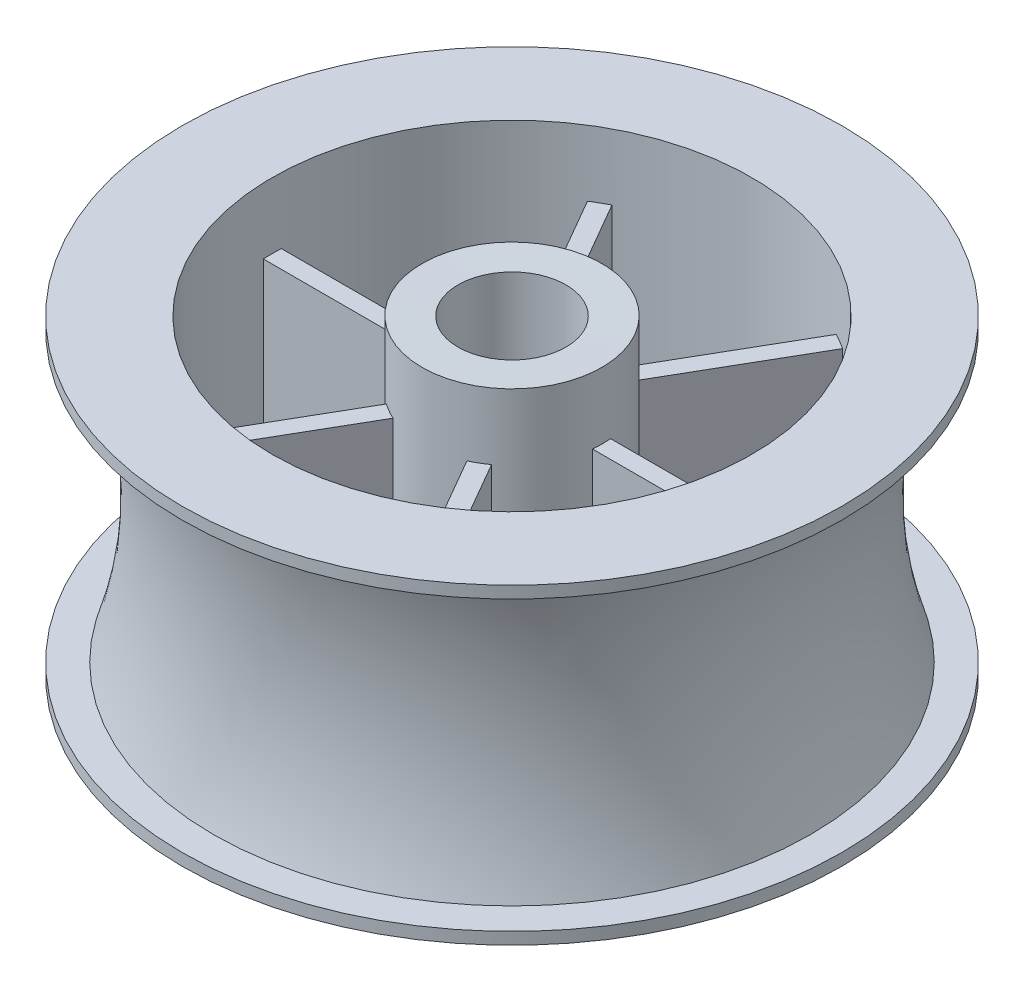
ISO-10303-21;
HEADER;
FILE_DESCRIPTION(('STEP AP214'),'2;1');
FILE_NAME('part.step','',(''),(''),'','','');
FILE_SCHEMA(('AUTOMOTIVE_DESIGN { 1 0 10303 214 1 1 1 1 }'));
ENDSEC;
DATA;
#1=APPLICATION_CONTEXT('core data for automotive mechanical design processes');
#2=APPLICATION_PROTOCOL_DEFINITION('international standard','automotive_design',2000,#1);
#3=PRODUCT_CONTEXT('',#1,'mechanical');
#4=PRODUCT('Part','Part','',(#3));
#5=PRODUCT_RELATED_PRODUCT_CATEGORY('part','',(#4));
#6=PRODUCT_DEFINITION_FORMATION('','',#4);
#7=PRODUCT_DEFINITION_CONTEXT('part definition',#1,'design');
#8=PRODUCT_DEFINITION('design','',#6,#7);
#9=PRODUCT_DEFINITION_SHAPE('','',#8);
#10=(LENGTH_UNIT() NAMED_UNIT(*) SI_UNIT(.MILLI.,.METRE.));
#11=(NAMED_UNIT(*) PLANE_ANGLE_UNIT() SI_UNIT($,.RADIAN.));
#12=(NAMED_UNIT(*) SI_UNIT($,.STERADIAN.) SOLID_ANGLE_UNIT());
#13=UNCERTAINTY_MEASURE_WITH_UNIT(LENGTH_MEASURE(1.E-05),#10,'distance_accuracy_value','');
#14=(GEOMETRIC_REPRESENTATION_CONTEXT(3) GLOBAL_UNCERTAINTY_ASSIGNED_CONTEXT((#13)) GLOBAL_UNIT_ASSIGNED_CONTEXT((#10,
#11,#12)) REPRESENTATION_CONTEXT('',''));
#15=CARTESIAN_POINT('',(0.,0.,0.));
#16=DIRECTION('',(0.,0.,1.));
#17=DIRECTION('',(1.,0.,0.));
#18=AXIS2_PLACEMENT_3D('',#15,#16,#17);
#19=CARTESIAN_POINT('',(0.,42.4047356774591,0.));
#20=DIRECTION('',(0.,1.,0.));
#21=DIRECTION('',(0.,0.,1.));
#22=AXIS2_PLACEMENT_3D('',#19,#20,#21);
#23=CYLINDRICAL_SURFACE('',#22,20.);
#24=CARTESIAN_POINT('',(0.,26.,0.));
#25=DIRECTION('',(0.,1.,0.));
#26=DIRECTION('',(0.,0.,1.));
#27=AXIS2_PLACEMENT_3D('',#24,#25,#26);
#28=CIRCLE('',#27,20.);
#29=CARTESIAN_POINT('',(0.,26.,20.));
#30=VERTEX_POINT('',#29);
#31=EDGE_CURVE('E342',#30,#30,#28,.T.);
#32=ORIENTED_EDGE('',*,*,#31,.T.);
#33=EDGE_LOOP('',(#32));
#34=FACE_BOUND('',#33,.T.);
#35=CARTESIAN_POINT('',(0.,0.,0.));
#36=DIRECTION('',(0.,1.,0.));
#37=DIRECTION('',(0.,0.,1.));
#38=AXIS2_PLACEMENT_3D('',#35,#36,#37);
#39=CIRCLE('',#38,20.);
#40=CARTESIAN_POINT('',(0.,0.,20.));
#41=VERTEX_POINT('',#40);
#42=EDGE_CURVE('E345',#41,#41,#39,.T.);
#43=ORIENTED_EDGE('',*,*,#42,.F.);
#44=EDGE_LOOP('',(#43));
#45=FACE_BOUND('',#44,.T.);
#46=DIRECTION('',(0.,1.,0.));
#47=VECTOR('',#46,1.);
#48=CARTESIAN_POINT('',(19.9859325526731,42.4047356774591,-0.75));
#49=LINE('',#48,#47);
#50=CARTESIAN_POINT('',(19.9859325526731,5.5,-0.75));
#51=VERTEX_POINT('',#50);
#52=CARTESIAN_POINT('',(19.9859325526731,20.5,-0.75));
#53=VERTEX_POINT('',#52);
#54=EDGE_CURVE('E366',#51,#53,#49,.T.);
#55=ORIENTED_EDGE('',*,*,#54,.T.);
#56=CARTESIAN_POINT('',(0.,20.5,0.));
#57=DIRECTION('',(0.,-1.,0.));
#58=DIRECTION('',(0.,0.,-1.));
#59=AXIS2_PLACEMENT_3D('',#56,#57,#58);
#60=CIRCLE('',#59,20.);
#61=CARTESIAN_POINT('',(19.9859325526731,20.5,0.75));
#62=VERTEX_POINT('',#61);
#63=EDGE_CURVE('E371',#53,#62,#60,.T.);
#64=ORIENTED_EDGE('',*,*,#63,.T.);
#65=DIRECTION('',(0.,1.,0.));
#66=VECTOR('',#65,1.);
#67=CARTESIAN_POINT('',(19.9859325526731,42.4047356774591,0.75));
#68=LINE('',#67,#66);
#69=CARTESIAN_POINT('',(19.9859325526731,5.5,0.75));
#70=VERTEX_POINT('',#69);
#71=EDGE_CURVE('E368',#62,#70,#68,.F.);
#72=ORIENTED_EDGE('',*,*,#71,.T.);
#73=CARTESIAN_POINT('',(0.,5.5,0.));
#74=DIRECTION('',(0.,-1.,0.));
#75=DIRECTION('',(0.,0.,-1.));
#76=AXIS2_PLACEMENT_3D('',#73,#74,#75);
#77=CIRCLE('',#76,20.);
#78=EDGE_CURVE('E363',#51,#70,#77,.T.);
#79=ORIENTED_EDGE('',*,*,#78,.F.);
#80=EDGE_LOOP('',(#55,#64,#72,#79));
#81=FACE_BOUND('',#80,.T.);
#82=DIRECTION('',(0.,1.,0.));
#83=VECTOR('',#82,1.);
#84=CARTESIAN_POINT('',(10.6424853291749,42.4047356774591,16.9333253089373));
#85=LINE('',#84,#83);
#86=CARTESIAN_POINT('',(10.6424853291749,5.5,16.9333253089373));
#87=VERTEX_POINT('',#86);
#88=CARTESIAN_POINT('',(10.6424853291749,20.5,16.9333253089373));
#89=VERTEX_POINT('',#88);
#90=EDGE_CURVE('E305',#87,#89,#85,.T.);
#91=ORIENTED_EDGE('',*,*,#90,.T.);
#92=CARTESIAN_POINT('',(0.,20.5,0.));
#93=DIRECTION('',(0.,-1.,0.));
#94=DIRECTION('',(0.,0.,-1.));
#95=AXIS2_PLACEMENT_3D('',#92,#93,#94);
#96=CIRCLE('',#95,20.);
#97=CARTESIAN_POINT('',(9.3434472234982,20.5,17.6833253089373));
#98=VERTEX_POINT('',#97);
#99=EDGE_CURVE('E303',#89,#98,#96,.T.);
#100=ORIENTED_EDGE('',*,*,#99,.T.);
#101=DIRECTION('',(0.,1.,0.));
#102=VECTOR('',#101,1.);
#103=CARTESIAN_POINT('',(9.3434472234982,42.4047356774591,17.6833253089373));
#104=LINE('',#103,#102);
#105=CARTESIAN_POINT('',(9.3434472234982,5.5,17.6833253089373));
#106=VERTEX_POINT('',#105);
#107=EDGE_CURVE('E307',#98,#106,#104,.F.);
#108=ORIENTED_EDGE('',*,*,#107,.T.);
#109=CARTESIAN_POINT('',(0.,5.5,0.));
#110=DIRECTION('',(0.,-1.,0.));
#111=DIRECTION('',(0.,0.,-1.));
#112=AXIS2_PLACEMENT_3D('',#109,#110,#111);
#113=CIRCLE('',#112,20.);
#114=EDGE_CURVE('E296',#87,#106,#113,.T.);
#115=ORIENTED_EDGE('',*,*,#114,.F.);
#116=EDGE_LOOP('',(#91,#100,#108,#115));
#117=FACE_BOUND('',#116,.T.);
#118=DIRECTION('',(0.,1.,0.));
#119=VECTOR('',#118,1.);
#120=CARTESIAN_POINT('',(-9.34344722349717,42.4047356774591,17.6833253089379));
#121=LINE('',#120,#119);
#122=CARTESIAN_POINT('',(-9.34344722349717,5.5,17.6833253089379));
#123=VERTEX_POINT('',#122);
#124=CARTESIAN_POINT('',(-9.34344722349717,20.5,17.6833253089379));
#125=VERTEX_POINT('',#124);
#126=EDGE_CURVE('E284',#123,#125,#121,.T.);
#127=ORIENTED_EDGE('',*,*,#126,.T.);
#128=CARTESIAN_POINT('',(0.,20.5,0.));
#129=DIRECTION('',(0.,-1.,0.));
#130=DIRECTION('',(0.,0.,-1.));
#131=AXIS2_PLACEMENT_3D('',#128,#129,#130);
#132=CIRCLE('',#131,20.);
#133=CARTESIAN_POINT('',(-10.6424853291739,20.5,16.933325308938));
#134=VERTEX_POINT('',#133);
#135=EDGE_CURVE('E282',#125,#134,#132,.T.);
#136=ORIENTED_EDGE('',*,*,#135,.T.);
#137=DIRECTION('',(0.,1.,0.));
#138=VECTOR('',#137,1.);
#139=CARTESIAN_POINT('',(-10.6424853291739,42.4047356774591,16.933325308938));
#140=LINE('',#139,#138);
#141=CARTESIAN_POINT('',(-10.6424853291739,5.5,16.933325308938));
#142=VERTEX_POINT('',#141);
#143=EDGE_CURVE('E286',#134,#142,#140,.F.);
#144=ORIENTED_EDGE('',*,*,#143,.T.);
#145=CARTESIAN_POINT('',(0.,5.5,0.));
#146=DIRECTION('',(0.,-1.,0.));
#147=DIRECTION('',(0.,0.,-1.));
#148=AXIS2_PLACEMENT_3D('',#145,#146,#147);
#149=CIRCLE('',#148,20.);
#150=EDGE_CURVE('E275',#123,#142,#149,.T.);
#151=ORIENTED_EDGE('',*,*,#150,.F.);
#152=EDGE_LOOP('',(#127,#136,#144,#151));
#153=FACE_BOUND('',#152,.T.);
#154=DIRECTION('',(0.,1.,0.));
#155=VECTOR('',#154,1.);
#156=CARTESIAN_POINT('',(-19.9859325526731,42.4047356774591,0.75000000000151));
#157=LINE('',#156,#155);
#158=CARTESIAN_POINT('',(-19.9859325526731,5.5,0.75000000000151));
#159=VERTEX_POINT('',#158);
#160=CARTESIAN_POINT('',(-19.9859325526731,20.5,0.75000000000151));
#161=VERTEX_POINT('',#160);
#162=EDGE_CURVE('E263',#159,#161,#157,.T.);
#163=ORIENTED_EDGE('',*,*,#162,.T.);
#164=CARTESIAN_POINT('',(0.,20.5,0.));
#165=DIRECTION('',(0.,-1.,0.));
#166=DIRECTION('',(0.,0.,-1.));
#167=AXIS2_PLACEMENT_3D('',#164,#165,#166);
#168=CIRCLE('',#167,20.);
#169=CARTESIAN_POINT('',(-19.9859325526732,20.5,-0.74999999999849));
#170=VERTEX_POINT('',#169);
#171=EDGE_CURVE('E261',#161,#170,#168,.T.);
#172=ORIENTED_EDGE('',*,*,#171,.T.);
#173=DIRECTION('',(0.,1.,0.));
#174=VECTOR('',#173,1.);
#175=CARTESIAN_POINT('',(-19.9859325526732,42.4047356774591,-0.74999999999849));
#176=LINE('',#175,#174);
#177=CARTESIAN_POINT('',(-19.9859325526732,5.5,-0.74999999999849));
#178=VERTEX_POINT('',#177);
#179=EDGE_CURVE('E265',#170,#178,#176,.F.);
#180=ORIENTED_EDGE('',*,*,#179,.T.);
#181=CARTESIAN_POINT('',(0.,5.5,0.));
#182=DIRECTION('',(0.,-1.,0.));
#183=DIRECTION('',(0.,0.,-1.));
#184=AXIS2_PLACEMENT_3D('',#181,#182,#183);
#185=CIRCLE('',#184,20.);
#186=EDGE_CURVE('E254',#159,#178,#185,.T.);
#187=ORIENTED_EDGE('',*,*,#186,.F.);
#188=EDGE_LOOP('',(#163,#172,#180,#187));
#189=FACE_BOUND('',#188,.T.);
#190=DIRECTION('',(0.,1.,0.));
#191=VECTOR('',#190,1.);
#192=CARTESIAN_POINT('',(-10.6424853291758,42.4047356774591,-16.9333253089367));
#193=LINE('',#192,#191);
#194=CARTESIAN_POINT('',(-10.6424853291758,5.5,-16.9333253089367));
#195=VERTEX_POINT('',#194);
#196=CARTESIAN_POINT('',(-10.6424853291758,20.5,-16.9333253089367));
#197=VERTEX_POINT('',#196);
#198=EDGE_CURVE('E242',#195,#197,#193,.T.);
#199=ORIENTED_EDGE('',*,*,#198,.T.);
#200=CARTESIAN_POINT('',(0.,20.5,0.));
#201=DIRECTION('',(0.,-1.,0.));
#202=DIRECTION('',(0.,0.,-1.));
#203=AXIS2_PLACEMENT_3D('',#200,#201,#202);
#204=CIRCLE('',#203,20.);
#205=CARTESIAN_POINT('',(-9.34344722349919,20.5,-17.6833253089368));
#206=VERTEX_POINT('',#205);
#207=EDGE_CURVE('E240',#197,#206,#204,.T.);
#208=ORIENTED_EDGE('',*,*,#207,.T.);
#209=DIRECTION('',(0.,1.,0.));
#210=VECTOR('',#209,1.);
#211=CARTESIAN_POINT('',(-9.34344722349919,42.4047356774591,-17.6833253089368));
#212=LINE('',#211,#210);
#213=CARTESIAN_POINT('',(-9.34344722349919,5.5,-17.6833253089368));
#214=VERTEX_POINT('',#213);
#215=EDGE_CURVE('E244',#206,#214,#212,.F.);
#216=ORIENTED_EDGE('',*,*,#215,.T.);
#217=CARTESIAN_POINT('',(0.,5.5,0.));
#218=DIRECTION('',(0.,-1.,0.));
#219=DIRECTION('',(0.,0.,-1.));
#220=AXIS2_PLACEMENT_3D('',#217,#218,#219);
#221=CIRCLE('',#220,20.);
#222=EDGE_CURVE('E233',#195,#214,#221,.T.);
#223=ORIENTED_EDGE('',*,*,#222,.F.);
#224=EDGE_LOOP('',(#199,#208,#216,#223));
#225=FACE_BOUND('',#224,.T.);
#226=DIRECTION('',(0.,1.,0.));
#227=VECTOR('',#226,1.);
#228=CARTESIAN_POINT('',(9.34344722349796,42.4047356774591,-17.6833253089375));
#229=LINE('',#228,#227);
#230=CARTESIAN_POINT('',(9.34344722349796,5.5,-17.6833253089375));
#231=VERTEX_POINT('',#230);
#232=CARTESIAN_POINT('',(9.34344722349796,20.5,-17.6833253089375));
#233=VERTEX_POINT('',#232);
#234=EDGE_CURVE('E52',#231,#233,#229,.T.);
#235=ORIENTED_EDGE('',*,*,#234,.T.);
#236=CARTESIAN_POINT('',(0.,20.5,0.));
#237=DIRECTION('',(0.,-1.,0.));
#238=DIRECTION('',(0.,0.,-1.));
#239=AXIS2_PLACEMENT_3D('',#236,#237,#238);
#240=CIRCLE('',#239,20.);
#241=CARTESIAN_POINT('',(10.6424853291746,20.5,-16.9333253089375));
#242=VERTEX_POINT('',#241);
#243=EDGE_CURVE('E47',#233,#242,#240,.T.);
#244=ORIENTED_EDGE('',*,*,#243,.T.);
#245=DIRECTION('',(0.,1.,0.));
#246=VECTOR('',#245,1.);
#247=CARTESIAN_POINT('',(10.6424853291746,42.4047356774591,-16.9333253089375));
#248=LINE('',#247,#246);
#249=CARTESIAN_POINT('',(10.6424853291746,5.5,-16.9333253089375));
#250=VERTEX_POINT('',#249);
#251=EDGE_CURVE('E223',#242,#250,#248,.F.);
#252=ORIENTED_EDGE('',*,*,#251,.T.);
#253=CARTESIAN_POINT('',(0.,5.5,0.));
#254=DIRECTION('',(0.,-1.,0.));
#255=DIRECTION('',(0.,0.,-1.));
#256=AXIS2_PLACEMENT_3D('',#253,#254,#255);
#257=CIRCLE('',#256,20.);
#258=EDGE_CURVE('E219',#231,#250,#257,.T.);
#259=ORIENTED_EDGE('',*,*,#258,.F.);
#260=EDGE_LOOP('',(#235,#244,#252,#259));
#261=FACE_BOUND('',#260,.T.);
#262=ADVANCED_FACE('F32',(#34,#45,#81,#117,#153,#189,#225,#261),#23,.F.);
#263=CARTESIAN_POINT('',(0.,42.4047356774591,0.));
#264=DIRECTION('',(0.,1.,0.));
#265=DIRECTION('',(0.,0.,1.));
#266=AXIS2_PLACEMENT_3D('',#263,#264,#265);
#267=CYLINDRICAL_SURFACE('',#266,7.49999999999999);
#268=CARTESIAN_POINT('',(0.,26.0370653806026,0.));
#269=DIRECTION('',(0.,1.,0.));
#270=DIRECTION('',(0.,0.,1.));
#271=AXIS2_PLACEMENT_3D('',#268,#269,#270);
#272=CIRCLE('',#271,7.49999999999999);
#273=CARTESIAN_POINT('',(0.,26.0370653806026,7.49999999999999));
#274=VERTEX_POINT('',#273);
#275=EDGE_CURVE('E309',#274,#274,#272,.T.);
#276=ORIENTED_EDGE('',*,*,#275,.F.);
#277=EDGE_LOOP('',(#276));
#278=FACE_BOUND('',#277,.T.);
#279=CARTESIAN_POINT('',(0.,0.,0.));
#280=DIRECTION('',(0.,1.,0.));
#281=DIRECTION('',(0.,0.,1.));
#282=AXIS2_PLACEMENT_3D('',#279,#280,#281);
#283=CIRCLE('',#282,7.49999999999999);
#284=CARTESIAN_POINT('',(0.,0.,7.49999999999999));
#285=VERTEX_POINT('',#284);
#286=EDGE_CURVE('E312',#285,#285,#283,.T.);
#287=ORIENTED_EDGE('',*,*,#286,.T.);
#288=EDGE_LOOP('',(#287));
#289=FACE_BOUND('',#288,.T.);
#290=DIRECTION('',(0.,1.,0.));
#291=VECTOR('',#290,1.);
#292=CARTESIAN_POINT('',(7.46240577829964,42.4047356774591,0.750000000000001));
#293=LINE('',#292,#291);
#294=CARTESIAN_POINT('',(7.46240577829964,20.5,0.750000000000001));
#295=VERTEX_POINT('',#294);
#296=CARTESIAN_POINT('',(7.46240577829964,5.5,0.750000000000001));
#297=VERTEX_POINT('',#296);
#298=EDGE_CURVE('E326',#295,#297,#293,.F.);
#299=ORIENTED_EDGE('',*,*,#298,.F.);
#300=CARTESIAN_POINT('',(0.,20.5,0.));
#301=DIRECTION('',(0.,-1.,0.));
#302=DIRECTION('',(0.,0.,-1.));
#303=AXIS2_PLACEMENT_3D('',#300,#301,#302);
#304=CIRCLE('',#303,7.49999999999999);
#305=CARTESIAN_POINT('',(7.46240577829964,20.5,-0.75));
#306=VERTEX_POINT('',#305);
#307=EDGE_CURVE('E323',#306,#295,#304,.T.);
#308=ORIENTED_EDGE('',*,*,#307,.F.);
#309=DIRECTION('',(0.,1.,0.));
#310=VECTOR('',#309,1.);
#311=CARTESIAN_POINT('',(7.46240577829964,42.4047356774591,-0.75));
#312=LINE('',#311,#310);
#313=CARTESIAN_POINT('',(7.46240577829964,5.50000000000001,-0.75));
#314=VERTEX_POINT('',#313);
#315=EDGE_CURVE('E374',#314,#306,#312,.T.);
#316=ORIENTED_EDGE('',*,*,#315,.F.);
#317=CARTESIAN_POINT('',(0.,5.5,0.));
#318=DIRECTION('',(0.,-1.,0.));
#319=DIRECTION('',(0.,0.,-1.));
#320=AXIS2_PLACEMENT_3D('',#317,#318,#319);
#321=CIRCLE('',#320,7.49999999999999);
#322=EDGE_CURVE('E321',#314,#297,#321,.T.);
#323=ORIENTED_EDGE('',*,*,#322,.T.);
#324=EDGE_LOOP('',(#299,#308,#316,#323));
#325=FACE_BOUND('',#324,.T.);
#326=DIRECTION('',(0.,1.,0.));
#327=VECTOR('',#326,1.);
#328=CARTESIAN_POINT('',(3.08168383631148,42.4047356774591,6.83763297735528));
#329=LINE('',#328,#327);
#330=CARTESIAN_POINT('',(3.08168383631148,5.5,6.83763297735528));
#331=VERTEX_POINT('',#330);
#332=CARTESIAN_POINT('',(3.08168383631148,20.5,6.83763297735528));
#333=VERTEX_POINT('',#332);
#334=EDGE_CURVE('E382',#331,#333,#329,.T.);
#335=ORIENTED_EDGE('',*,*,#334,.T.);
#336=CARTESIAN_POINT('',(0.,20.5,0.));
#337=DIRECTION('',(0.,-1.,0.));
#338=DIRECTION('',(0.,0.,-1.));
#339=AXIS2_PLACEMENT_3D('',#336,#337,#338);
#340=CIRCLE('',#339,7.49999999999999);
#341=CARTESIAN_POINT('',(4.38072194198814,20.5,6.08763297735529));
#342=VERTEX_POINT('',#341);
#343=EDGE_CURVE('E384',#333,#342,#340,.F.);
#344=ORIENTED_EDGE('',*,*,#343,.T.);
#345=DIRECTION('',(0.,1.,0.));
#346=VECTOR('',#345,1.);
#347=CARTESIAN_POINT('',(4.38072194198814,42.4047356774591,6.08763297735529));
#348=LINE('',#347,#346);
#349=CARTESIAN_POINT('',(4.38072194198814,5.5,6.08763297735529));
#350=VERTEX_POINT('',#349);
#351=EDGE_CURVE('E380',#342,#350,#348,.F.);
#352=ORIENTED_EDGE('',*,*,#351,.T.);
#353=CARTESIAN_POINT('',(0.,5.5,0.));
#354=DIRECTION('',(0.,-1.,0.));
#355=DIRECTION('',(0.,0.,-1.));
#356=AXIS2_PLACEMENT_3D('',#353,#354,#355);
#357=CIRCLE('',#356,7.49999999999999);
#358=EDGE_CURVE('E377',#331,#350,#357,.F.);
#359=ORIENTED_EDGE('',*,*,#358,.F.);
#360=EDGE_LOOP('',(#335,#344,#352,#359));
#361=FACE_BOUND('',#360,.T.);
#362=DIRECTION('',(0.,1.,0.));
#363=VECTOR('',#362,1.);
#364=CARTESIAN_POINT('',(-4.38072194198717,42.4047356774591,6.08763297735598));
#365=LINE('',#364,#363);
#366=CARTESIAN_POINT('',(-4.38072194198717,5.5,6.08763297735598));
#367=VERTEX_POINT('',#366);
#368=CARTESIAN_POINT('',(-4.38072194198717,20.5,6.08763297735598));
#369=VERTEX_POINT('',#368);
#370=EDGE_CURVE('E391',#367,#369,#365,.T.);
#371=ORIENTED_EDGE('',*,*,#370,.T.);
#372=CARTESIAN_POINT('',(0.,20.5,0.));
#373=DIRECTION('',(0.,-1.,0.));
#374=DIRECTION('',(0.,0.,-1.));
#375=AXIS2_PLACEMENT_3D('',#372,#373,#374);
#376=CIRCLE('',#375,7.49999999999999);
#377=CARTESIAN_POINT('',(-3.08168383631039,20.5,6.83763297735578));
#378=VERTEX_POINT('',#377);
#379=EDGE_CURVE('E393',#369,#378,#376,.F.);
#380=ORIENTED_EDGE('',*,*,#379,.T.);
#381=DIRECTION('',(0.,1.,0.));
#382=VECTOR('',#381,1.);
#383=CARTESIAN_POINT('',(-3.08168383631039,42.4047356774591,6.83763297735578));
#384=LINE('',#383,#382);
#385=CARTESIAN_POINT('',(-3.08168383631039,5.5,6.83763297735578));
#386=VERTEX_POINT('',#385);
#387=EDGE_CURVE('E389',#378,#386,#384,.F.);
#388=ORIENTED_EDGE('',*,*,#387,.T.);
#389=CARTESIAN_POINT('',(0.,5.5,0.));
#390=DIRECTION('',(0.,-1.,0.));
#391=DIRECTION('',(0.,0.,-1.));
#392=AXIS2_PLACEMENT_3D('',#389,#390,#391);
#393=CIRCLE('',#392,7.49999999999999);
#394=EDGE_CURVE('E386',#367,#386,#393,.F.);
#395=ORIENTED_EDGE('',*,*,#394,.F.);
#396=EDGE_LOOP('',(#371,#380,#388,#395));
#397=FACE_BOUND('',#396,.T.);
#398=DIRECTION('',(0.,1.,0.));
#399=VECTOR('',#398,1.);
#400=CARTESIAN_POINT('',(-7.46240577829979,42.4047356774591,-0.749999999998493));
#401=LINE('',#400,#399);
#402=CARTESIAN_POINT('',(-7.46240577829979,5.5,-0.749999999998493));
#403=VERTEX_POINT('',#402);
#404=CARTESIAN_POINT('',(-7.46240577829979,20.5,-0.749999999998493));
#405=VERTEX_POINT('',#404);
#406=EDGE_CURVE('E400',#403,#405,#401,.T.);
#407=ORIENTED_EDGE('',*,*,#406,.T.);
#408=CARTESIAN_POINT('',(0.,20.5,0.));
#409=DIRECTION('',(0.,-1.,0.));
#410=DIRECTION('',(0.,0.,-1.));
#411=AXIS2_PLACEMENT_3D('',#408,#409,#410);
#412=CIRCLE('',#411,7.49999999999999);
#413=CARTESIAN_POINT('',(-7.46240577829949,20.5,0.750000000001509));
#414=VERTEX_POINT('',#413);
#415=EDGE_CURVE('E402',#405,#414,#412,.F.);
#416=ORIENTED_EDGE('',*,*,#415,.T.);
#417=DIRECTION('',(0.,1.,0.));
#418=VECTOR('',#417,1.);
#419=CARTESIAN_POINT('',(-7.46240577829949,42.4047356774591,0.750000000001509));
#420=LINE('',#419,#418);
#421=CARTESIAN_POINT('',(-7.46240577829949,5.5,0.750000000001509));
#422=VERTEX_POINT('',#421);
#423=EDGE_CURVE('E398',#414,#422,#420,.F.);
#424=ORIENTED_EDGE('',*,*,#423,.T.);
#425=CARTESIAN_POINT('',(0.,5.5,0.));
#426=DIRECTION('',(0.,-1.,0.));
#427=DIRECTION('',(0.,0.,-1.));
#428=AXIS2_PLACEMENT_3D('',#425,#426,#427);
#429=CIRCLE('',#428,7.49999999999999);
#430=EDGE_CURVE('E395',#403,#422,#429,.F.);
#431=ORIENTED_EDGE('',*,*,#430,.F.);
#432=EDGE_LOOP('',(#407,#416,#424,#431));
#433=FACE_BOUND('',#432,.T.);
#434=DIRECTION('',(0.,1.,0.));
#435=VECTOR('',#434,1.);
#436=CARTESIAN_POINT('',(-3.08168383631247,42.4047356774591,-6.83763297735484));
#437=LINE('',#436,#435);
#438=CARTESIAN_POINT('',(-3.08168383631247,5.5,-6.83763297735484));
#439=VERTEX_POINT('',#438);
#440=CARTESIAN_POINT('',(-3.08168383631247,20.5,-6.83763297735484));
#441=VERTEX_POINT('',#440);
#442=EDGE_CURVE('E409',#439,#441,#437,.T.);
#443=ORIENTED_EDGE('',*,*,#442,.T.);
#444=CARTESIAN_POINT('',(0.,20.5,0.));
#445=DIRECTION('',(0.,-1.,0.));
#446=DIRECTION('',(0.,0.,-1.));
#447=AXIS2_PLACEMENT_3D('',#444,#445,#446);
#448=CIRCLE('',#447,7.49999999999999);
#449=CARTESIAN_POINT('',(-4.38072194198902,20.5,-6.08763297735465));
#450=VERTEX_POINT('',#449);
#451=EDGE_CURVE('E208',#441,#450,#448,.F.);
#452=ORIENTED_EDGE('',*,*,#451,.T.);
#453=DIRECTION('',(0.,1.,0.));
#454=VECTOR('',#453,1.);
#455=CARTESIAN_POINT('',(-4.38072194198902,42.4047356774591,-6.08763297735465));
#456=LINE('',#455,#454);
#457=CARTESIAN_POINT('',(-4.38072194198902,5.5,-6.08763297735465));
#458=VERTEX_POINT('',#457);
#459=EDGE_CURVE('E407',#450,#458,#456,.F.);
#460=ORIENTED_EDGE('',*,*,#459,.T.);
#461=CARTESIAN_POINT('',(0.,5.5,0.));
#462=DIRECTION('',(0.,-1.,0.));
#463=DIRECTION('',(0.,0.,-1.));
#464=AXIS2_PLACEMENT_3D('',#461,#462,#463);
#465=CIRCLE('',#464,7.49999999999999);
#466=EDGE_CURVE('E404',#439,#458,#465,.F.);
#467=ORIENTED_EDGE('',*,*,#466,.F.);
#468=EDGE_LOOP('',(#443,#452,#460,#467));
#469=FACE_BOUND('',#468,.T.);
#470=DIRECTION('',(0.,1.,0.));
#471=VECTOR('',#470,1.);
#472=CARTESIAN_POINT('',(4.3807219419882,42.4047356774591,-6.08763297735524));
#473=LINE('',#472,#471);
#474=CARTESIAN_POINT('',(4.3807219419882,5.5,-6.08763297735524));
#475=VERTEX_POINT('',#474);
#476=CARTESIAN_POINT('',(4.3807219419882,20.5,-6.08763297735524));
#477=VERTEX_POINT('',#476);
#478=EDGE_CURVE('E40',#475,#477,#473,.T.);
#479=ORIENTED_EDGE('',*,*,#478,.T.);
#480=CARTESIAN_POINT('',(0.,20.5,0.));
#481=DIRECTION('',(0.,-1.,0.));
#482=DIRECTION('',(0.,0.,-1.));
#483=AXIS2_PLACEMENT_3D('',#480,#481,#482);
#484=CIRCLE('',#483,7.49999999999999);
#485=CARTESIAN_POINT('',(3.08168383631121,20.5,-6.83763297735541));
#486=VERTEX_POINT('',#485);
#487=EDGE_CURVE('E11',#477,#486,#484,.F.);
#488=ORIENTED_EDGE('',*,*,#487,.T.);
#489=DIRECTION('',(0.,1.,0.));
#490=VECTOR('',#489,1.);
#491=CARTESIAN_POINT('',(3.08168383631121,42.4047356774591,-6.83763297735541));
#492=LINE('',#491,#490);
#493=CARTESIAN_POINT('',(3.08168383631121,5.5,-6.83763297735541));
#494=VERTEX_POINT('',#493);
#495=EDGE_CURVE('E189',#486,#494,#492,.F.);
#496=ORIENTED_EDGE('',*,*,#495,.T.);
#497=CARTESIAN_POINT('',(0.,5.5,0.));
#498=DIRECTION('',(0.,-1.,0.));
#499=DIRECTION('',(0.,0.,-1.));
#500=AXIS2_PLACEMENT_3D('',#497,#498,#499);
#501=CIRCLE('',#500,7.49999999999999);
#502=EDGE_CURVE('E192',#475,#494,#501,.F.);
#503=ORIENTED_EDGE('',*,*,#502,.F.);
#504=EDGE_LOOP('',(#479,#488,#496,#503));
#505=FACE_BOUND('',#504,.T.);
#506=ADVANCED_FACE('F191',(#278,#289,#325,#361,#397,#433,#469,#505),#267,.T.);
#507=CARTESIAN_POINT('',(0.,42.4047356774591,0.));
#508=DIRECTION('',(0.,1.,0.));
#509=DIRECTION('',(0.,0.,1.));
#510=AXIS2_PLACEMENT_3D('',#507,#508,#509);
#511=CYLINDRICAL_SURFACE('',#510,27.5);
#512=CARTESIAN_POINT('',(0.,25.,0.));
#513=DIRECTION('',(0.,1.,0.));
#514=DIRECTION('',(0.,0.,1.));
#515=AXIS2_PLACEMENT_3D('',#512,#513,#514);
#516=CIRCLE('',#515,27.5);
#517=CARTESIAN_POINT('',(0.,25.,27.5));
#518=VERTEX_POINT('',#517);
#519=EDGE_CURVE('E360',#518,#518,#516,.T.);
#520=ORIENTED_EDGE('',*,*,#519,.T.);
#521=EDGE_LOOP('',(#520));
#522=FACE_BOUND('',#521,.T.);
#523=CARTESIAN_POINT('',(0.,26.,0.));
#524=DIRECTION('',(0.,1.,0.));
#525=DIRECTION('',(0.,0.,1.));
#526=AXIS2_PLACEMENT_3D('',#523,#524,#525);
#527=CIRCLE('',#526,27.5);
#528=CARTESIAN_POINT('',(0.,26.,27.5));
#529=VERTEX_POINT('',#528);
#530=EDGE_CURVE('E336',#529,#529,#527,.T.);
#531=ORIENTED_EDGE('',*,*,#530,.F.);
#532=EDGE_LOOP('',(#531));
#533=FACE_BOUND('',#532,.T.);
#534=ADVANCED_FACE('F34',(#522,#533),#511,.T.);
#535=CARTESIAN_POINT('',(-27.5,25.,0.));
#536=DIRECTION('',(0.,-1.,0.));
#537=DIRECTION('',(0.,0.,-1.));
#538=AXIS2_PLACEMENT_3D('',#535,#536,#537);
#539=PLANE('',#538);
#540=CARTESIAN_POINT('',(0.,25.,0.));
#541=DIRECTION('',(0.,1.,0.));
#542=DIRECTION('',(0.,0.,1.));
#543=AXIS2_PLACEMENT_3D('',#540,#541,#542);
#544=CIRCLE('',#543,24.9);
#545=CARTESIAN_POINT('',(0.,25.,24.9));
#546=VERTEX_POINT('',#545);
#547=EDGE_CURVE('E357',#546,#546,#544,.T.);
#548=ORIENTED_EDGE('',*,*,#547,.T.);
#549=EDGE_LOOP('',(#548));
#550=FACE_BOUND('',#549,.T.);
#551=ORIENTED_EDGE('',*,*,#519,.F.);
#552=EDGE_LOOP('',(#551));
#553=FACE_BOUND('',#552,.T.);
#554=ADVANCED_FACE('F443',(#550,#553),#539,.T.);
#555=CARTESIAN_POINT('',(0.,13.,0.));
#556=DIRECTION('',(0.,1.,0.));
#557=DIRECTION('',(0.,0.,1.));
#558=AXIS2_PLACEMENT_3D('',#555,#556,#557);
#559=TOROIDAL_SURFACE('',#558,63.0575680566778,40.);
#560=CARTESIAN_POINT('',(0.,1.,0.));
#561=DIRECTION('',(0.,1.,0.));
#562=DIRECTION('',(0.,0.,1.));
#563=AXIS2_PLACEMENT_3D('',#560,#561,#562);
#564=CIRCLE('',#563,24.9);
#565=CARTESIAN_POINT('',(0.,1.,24.9));
#566=VERTEX_POINT('',#565);
#567=EDGE_CURVE('E354',#566,#566,#564,.T.);
#568=ORIENTED_EDGE('',*,*,#567,.T.);
#569=EDGE_LOOP('',(#568));
#570=FACE_BOUND('',#569,.T.);
#571=ORIENTED_EDGE('',*,*,#547,.F.);
#572=EDGE_LOOP('',(#571));
#573=FACE_BOUND('',#572,.T.);
#574=ADVANCED_FACE('F440',(#570,#573),#559,.F.);
#575=CARTESIAN_POINT('',(-24.9,1.,0.));
#576=DIRECTION('',(0.,1.,0.));
#577=DIRECTION('',(0.,0.,1.));
#578=AXIS2_PLACEMENT_3D('',#575,#576,#577);
#579=PLANE('',#578);
#580=CARTESIAN_POINT('',(0.,1.,0.));
#581=DIRECTION('',(0.,1.,0.));
#582=DIRECTION('',(0.,0.,1.));
#583=AXIS2_PLACEMENT_3D('',#580,#581,#582);
#584=CIRCLE('',#583,27.5);
#585=CARTESIAN_POINT('',(0.,1.,27.5));
#586=VERTEX_POINT('',#585);
#587=EDGE_CURVE('E351',#586,#586,#584,.T.);
#588=ORIENTED_EDGE('',*,*,#587,.T.);
#589=EDGE_LOOP('',(#588));
#590=FACE_BOUND('',#589,.T.);
#591=ORIENTED_EDGE('',*,*,#567,.F.);
#592=EDGE_LOOP('',(#591));
#593=FACE_BOUND('',#592,.T.);
#594=ADVANCED_FACE('F436',(#590,#593),#579,.T.);
#595=CARTESIAN_POINT('',(0.,42.4047356774591,0.));
#596=DIRECTION('',(0.,1.,0.));
#597=DIRECTION('',(0.,0.,1.));
#598=AXIS2_PLACEMENT_3D('',#595,#596,#597);
#599=CYLINDRICAL_SURFACE('',#598,27.5);
#600=CARTESIAN_POINT('',(0.,0.,0.));
#601=DIRECTION('',(0.,1.,0.));
#602=DIRECTION('',(0.,0.,1.));
#603=AXIS2_PLACEMENT_3D('',#600,#601,#602);
#604=CIRCLE('',#603,27.5);
#605=CARTESIAN_POINT('',(0.,0.,27.5));
#606=VERTEX_POINT('',#605);
#607=EDGE_CURVE('E348',#606,#606,#604,.T.);
#608=ORIENTED_EDGE('',*,*,#607,.T.);
#609=EDGE_LOOP('',(#608));
#610=FACE_BOUND('',#609,.T.);
#611=ORIENTED_EDGE('',*,*,#587,.F.);
#612=EDGE_LOOP('',(#611));
#613=FACE_BOUND('',#612,.T.);
#614=ADVANCED_FACE('F432',(#610,#613),#599,.T.);
#615=CARTESIAN_POINT('',(-27.5,0.,0.));
#616=DIRECTION('',(0.,-1.,0.));
#617=DIRECTION('',(0.,0.,-1.));
#618=AXIS2_PLACEMENT_3D('',#615,#616,#617);
#619=PLANE('',#618);
#620=ORIENTED_EDGE('',*,*,#42,.T.);
#621=EDGE_LOOP('',(#620));
#622=FACE_BOUND('',#621,.T.);
#623=ORIENTED_EDGE('',*,*,#607,.F.);
#624=EDGE_LOOP('',(#623));
#625=FACE_BOUND('',#624,.T.);
#626=ADVANCED_FACE('F429',(#622,#625),#619,.T.);
#627=CARTESIAN_POINT('',(-20.,26.,0.));
#628=DIRECTION('',(0.,1.,0.));
#629=DIRECTION('',(0.,0.,1.));
#630=AXIS2_PLACEMENT_3D('',#627,#628,#629);
#631=PLANE('',#630);
#632=ORIENTED_EDGE('',*,*,#530,.T.);
#633=EDGE_LOOP('',(#632));
#634=FACE_BOUND('',#633,.T.);
#635=ORIENTED_EDGE('',*,*,#31,.F.);
#636=EDGE_LOOP('',(#635));
#637=FACE_BOUND('',#636,.T.);
#638=ADVANCED_FACE('F427',(#634,#637),#631,.T.);
#639=CARTESIAN_POINT('',(0.,20.5,0.));
#640=DIRECTION('',(0.,-1.,0.));
#641=DIRECTION('',(0.,0.,-1.));
#642=AXIS2_PLACEMENT_3D('',#639,#640,#641);
#643=PLANE('',#642);
#644=DIRECTION('',(-1.,0.,0.));
#645=VECTOR('',#644,1.);
#646=CARTESIAN_POINT('',(6.83403868968979,20.5,-0.75));
#647=LINE('',#646,#645);
#648=EDGE_CURVE('E332',#53,#306,#647,.T.);
#649=ORIENTED_EDGE('',*,*,#648,.T.);
#650=ORIENTED_EDGE('',*,*,#307,.T.);
#651=DIRECTION('',(1.,0.,0.));
#652=VECTOR('',#651,1.);
#653=CARTESIAN_POINT('',(20.4487305753258,20.5,0.75));
#654=LINE('',#653,#652);
#655=EDGE_CURVE('E330',#295,#62,#654,.T.);
#656=ORIENTED_EDGE('',*,*,#655,.T.);
#657=ORIENTED_EDGE('',*,*,#63,.F.);
#658=EDGE_LOOP('',(#649,#650,#656,#657));
#659=FACE_BOUND('',#658,.T.);
#660=ADVANCED_FACE('F459',(#659),#643,.F.);
#661=CARTESIAN_POINT('',(0.,5.5,0.));
#662=DIRECTION('',(0.,-1.,0.));
#663=DIRECTION('',(0.,0.,-1.));
#664=AXIS2_PLACEMENT_3D('',#661,#662,#663);
#665=PLANE('',#664);
#666=ORIENTED_EDGE('',*,*,#322,.F.);
#667=DIRECTION('',(-1.,0.,0.));
#668=VECTOR('',#667,1.);
#669=CARTESIAN_POINT('',(6.83403868968979,5.5,-0.75));
#670=LINE('',#669,#668);
#671=EDGE_CURVE('E333',#51,#314,#670,.T.);
#672=ORIENTED_EDGE('',*,*,#671,.F.);
#673=ORIENTED_EDGE('',*,*,#78,.T.);
#674=DIRECTION('',(1.,0.,0.));
#675=VECTOR('',#674,1.);
#676=CARTESIAN_POINT('',(20.4487305753258,5.5,0.75));
#677=LINE('',#676,#675);
#678=EDGE_CURVE('E329',#297,#70,#677,.T.);
#679=ORIENTED_EDGE('',*,*,#678,.F.);
#680=EDGE_LOOP('',(#666,#672,#673,#679));
#681=FACE_BOUND('',#680,.T.);
#682=ADVANCED_FACE('F464',(#681),#665,.T.);
#683=CARTESIAN_POINT('',(20.4487305753258,20.5,0.75));
#684=DIRECTION('',(0.,0.,-1.));
#685=DIRECTION('',(-1.,0.,0.));
#686=AXIS2_PLACEMENT_3D('',#683,#684,#685);
#687=PLANE('',#686);
#688=ORIENTED_EDGE('',*,*,#655,.F.);
#689=ORIENTED_EDGE('',*,*,#298,.T.);
#690=ORIENTED_EDGE('',*,*,#678,.T.);
#691=ORIENTED_EDGE('',*,*,#71,.F.);
#692=EDGE_LOOP('',(#688,#689,#690,#691));
#693=FACE_BOUND('',#692,.T.);
#694=ADVANCED_FACE('F470',(#693),#687,.F.);
#695=CARTESIAN_POINT('',(6.83403868968979,20.5,-0.75));
#696=DIRECTION('',(0.,0.,1.));
#697=DIRECTION('',(1.,0.,0.));
#698=AXIS2_PLACEMENT_3D('',#695,#696,#697);
#699=PLANE('',#698);
#700=ORIENTED_EDGE('',*,*,#671,.T.);
#701=ORIENTED_EDGE('',*,*,#315,.T.);
#702=ORIENTED_EDGE('',*,*,#648,.F.);
#703=ORIENTED_EDGE('',*,*,#54,.F.);
#704=EDGE_LOOP('',(#700,#701,#702,#703));
#705=FACE_BOUND('',#704,.T.);
#706=ADVANCED_FACE('F477',(#705),#699,.F.);
#707=CARTESIAN_POINT('',(0.,26.,0.));
#708=DIRECTION('',(0.,1.,0.));
#709=DIRECTION('',(0.,0.,1.));
#710=AXIS2_PLACEMENT_3D('',#707,#708,#709);
#711=CONICAL_SURFACE('',#710,4.5,1.55844182853636);
#712=ORIENTED_EDGE('',*,*,#275,.T.);
#713=EDGE_LOOP('',(#712));
#714=FACE_BOUND('',#713,.T.);
#715=CARTESIAN_POINT('',(0.,26.,0.));
#716=DIRECTION('',(0.,1.,0.));
#717=DIRECTION('',(0.,0.,1.));
#718=AXIS2_PLACEMENT_3D('',#715,#716,#717);
#719=CIRCLE('',#718,4.5);
#720=CARTESIAN_POINT('',(0.,26.,4.5));
#721=VERTEX_POINT('',#720);
#722=EDGE_CURVE('E318',#721,#721,#719,.T.);
#723=ORIENTED_EDGE('',*,*,#722,.F.);
#724=EDGE_LOOP('',(#723));
#725=FACE_BOUND('',#724,.T.);
#726=ADVANCED_FACE('F474',(#714,#725),#711,.F.);
#727=CARTESIAN_POINT('',(0.,42.4047356774591,0.));
#728=DIRECTION('',(0.,1.,0.));
#729=DIRECTION('',(0.,0.,1.));
#730=AXIS2_PLACEMENT_3D('',#727,#728,#729);
#731=CYLINDRICAL_SURFACE('',#730,4.5);
#732=ORIENTED_EDGE('',*,*,#722,.T.);
#733=EDGE_LOOP('',(#732));
#734=FACE_BOUND('',#733,.T.);
#735=CARTESIAN_POINT('',(0.,0.,0.));
#736=DIRECTION('',(0.,1.,0.));
#737=DIRECTION('',(0.,0.,1.));
#738=AXIS2_PLACEMENT_3D('',#735,#736,#737);
#739=CIRCLE('',#738,4.5);
#740=CARTESIAN_POINT('',(0.,0.,4.5));
#741=VERTEX_POINT('',#740);
#742=EDGE_CURVE('E315',#741,#741,#739,.T.);
#743=ORIENTED_EDGE('',*,*,#742,.F.);
#744=EDGE_LOOP('',(#743));
#745=FACE_BOUND('',#744,.T.);
#746=ADVANCED_FACE('F584',(#734,#745),#731,.F.);
#747=CARTESIAN_POINT('',(-4.5,0.,0.));
#748=DIRECTION('',(0.,-1.,0.));
#749=DIRECTION('',(0.,0.,-1.));
#750=AXIS2_PLACEMENT_3D('',#747,#748,#749);
#751=PLANE('',#750);
#752=ORIENTED_EDGE('',*,*,#742,.T.);
#753=EDGE_LOOP('',(#752));
#754=FACE_BOUND('',#753,.T.);
#755=ORIENTED_EDGE('',*,*,#286,.F.);
#756=EDGE_LOOP('',(#755));
#757=FACE_BOUND('',#756,.T.);
#758=ADVANCED_FACE('F580',(#754,#757),#751,.T.);
#759=CARTESIAN_POINT('',(9.57484623482453,20.5,18.0841201533757));
#760=DIRECTION('',(0.86602540378444,0.,-0.499999999999998));
#761=DIRECTION('',(-0.499999999999998,0.,-0.86602540378444));
#762=AXIS2_PLACEMENT_3D('',#759,#760,#761);
#763=PLANE('',#762);
#764=ORIENTED_EDGE('',*,*,#107,.F.);
#765=DIRECTION('',(0.499999999999998,0.,0.86602540378444));
#766=VECTOR('',#765,1.);
#767=CARTESIAN_POINT('',(9.57484623482453,20.5,18.0841201533757));
#768=LINE('',#767,#766);
#769=EDGE_CURVE('E289',#333,#98,#768,.T.);
#770=ORIENTED_EDGE('',*,*,#769,.F.);
#771=ORIENTED_EDGE('',*,*,#334,.F.);
#772=DIRECTION('',(0.499999999999998,0.,0.86602540378444));
#773=VECTOR('',#772,1.);
#774=CARTESIAN_POINT('',(9.57484623482453,5.5,18.0841201533757));
#775=LINE('',#774,#773);
#776=EDGE_CURVE('E288',#331,#106,#775,.T.);
#777=ORIENTED_EDGE('',*,*,#776,.T.);
#778=EDGE_LOOP('',(#764,#770,#771,#777));
#779=FACE_BOUND('',#778,.T.);
#780=ADVANCED_FACE('F577',(#779),#763,.F.);
#781=CARTESIAN_POINT('',(4.06653839768321,20.5,5.54345111571708));
#782=DIRECTION('',(-0.86602540378444,0.,0.499999999999998));
#783=DIRECTION('',(0.499999999999998,0.,0.86602540378444));
#784=AXIS2_PLACEMENT_3D('',#781,#782,#783);
#785=PLANE('',#784);
#786=ORIENTED_EDGE('',*,*,#90,.F.);
#787=DIRECTION('',(-0.499999999999998,0.,-0.86602540378444));
#788=VECTOR('',#787,1.);
#789=CARTESIAN_POINT('',(4.06653839768321,5.5,5.54345111571708));
#790=LINE('',#789,#788);
#791=EDGE_CURVE('E293',#87,#350,#790,.T.);
#792=ORIENTED_EDGE('',*,*,#791,.T.);
#793=ORIENTED_EDGE('',*,*,#351,.F.);
#794=DIRECTION('',(-0.499999999999998,0.,-0.86602540378444));
#795=VECTOR('',#794,1.);
#796=CARTESIAN_POINT('',(4.06653839768321,20.5,5.54345111571708));
#797=LINE('',#796,#795);
#798=EDGE_CURVE('E292',#89,#342,#797,.T.);
#799=ORIENTED_EDGE('',*,*,#798,.F.);
#800=EDGE_LOOP('',(#786,#792,#793,#799));
#801=FACE_BOUND('',#800,.T.);
#802=ADVANCED_FACE('F570',(#801),#785,.F.);
#803=CARTESIAN_POINT('',(0.,20.5,0.));
#804=DIRECTION('',(0.,-1.,0.));
#805=DIRECTION('',(0.,0.,-1.));
#806=AXIS2_PLACEMENT_3D('',#803,#804,#805);
#807=PLANE('',#806);
#808=ORIENTED_EDGE('',*,*,#99,.F.);
#809=ORIENTED_EDGE('',*,*,#798,.T.);
#810=ORIENTED_EDGE('',*,*,#343,.F.);
#811=ORIENTED_EDGE('',*,*,#769,.T.);
#812=EDGE_LOOP('',(#808,#809,#810,#811));
#813=FACE_BOUND('',#812,.T.);
#814=ADVANCED_FACE('F567',(#813),#807,.F.);
#815=CARTESIAN_POINT('',(0.,5.5,0.));
#816=DIRECTION('',(0.,-1.,0.));
#817=DIRECTION('',(0.,0.,-1.));
#818=AXIS2_PLACEMENT_3D('',#815,#816,#817);
#819=PLANE('',#818);
#820=ORIENTED_EDGE('',*,*,#791,.F.);
#821=ORIENTED_EDGE('',*,*,#114,.T.);
#822=ORIENTED_EDGE('',*,*,#776,.F.);
#823=ORIENTED_EDGE('',*,*,#358,.T.);
#824=EDGE_LOOP('',(#820,#821,#822,#823));
#825=FACE_BOUND('',#824,.T.);
#826=ADVANCED_FACE('F565',(#825),#819,.T.);
#827=CARTESIAN_POINT('',(-10.8738843405004,20.5,17.3341201533768));
#828=DIRECTION('',(0.866025403784439,0.,0.5));
#829=DIRECTION('',(0.5,0.,-0.866025403784439));
#830=AXIS2_PLACEMENT_3D('',#827,#828,#829);
#831=PLANE('',#830);
#832=ORIENTED_EDGE('',*,*,#143,.F.);
#833=DIRECTION('',(-0.5,0.,0.866025403784439));
#834=VECTOR('',#833,1.);
#835=CARTESIAN_POINT('',(-10.8738843405004,20.5,17.3341201533768));
#836=LINE('',#835,#834);
#837=EDGE_CURVE('E268',#369,#134,#836,.T.);
#838=ORIENTED_EDGE('',*,*,#837,.F.);
#839=ORIENTED_EDGE('',*,*,#370,.F.);
#840=DIRECTION('',(-0.5,0.,0.866025403784439));
#841=VECTOR('',#840,1.);
#842=CARTESIAN_POINT('',(-10.8738843405004,5.5,17.3341201533768));
#843=LINE('',#842,#841);
#844=EDGE_CURVE('E267',#367,#142,#843,.T.);
#845=ORIENTED_EDGE('',*,*,#844,.T.);
#846=EDGE_LOOP('',(#832,#838,#839,#845));
#847=FACE_BOUND('',#846,.T.);
#848=ADVANCED_FACE('F561',(#847),#831,.F.);
#849=CARTESIAN_POINT('',(-2.76750029200578,20.5,6.29345111571813));
#850=DIRECTION('',(-0.866025403784439,0.,-0.5));
#851=DIRECTION('',(-0.5,0.,0.866025403784439));
#852=AXIS2_PLACEMENT_3D('',#849,#850,#851);
#853=PLANE('',#852);
#854=ORIENTED_EDGE('',*,*,#126,.F.);
#855=DIRECTION('',(0.5,0.,-0.866025403784439));
#856=VECTOR('',#855,1.);
#857=CARTESIAN_POINT('',(-2.76750029200578,5.5,6.29345111571813));
#858=LINE('',#857,#856);
#859=EDGE_CURVE('E272',#123,#386,#858,.T.);
#860=ORIENTED_EDGE('',*,*,#859,.T.);
#861=ORIENTED_EDGE('',*,*,#387,.F.);
#862=DIRECTION('',(0.5,0.,-0.866025403784439));
#863=VECTOR('',#862,1.);
#864=CARTESIAN_POINT('',(-2.76750029200578,20.5,6.29345111571813));
#865=LINE('',#864,#863);
#866=EDGE_CURVE('E271',#125,#378,#865,.T.);
#867=ORIENTED_EDGE('',*,*,#866,.F.);
#868=EDGE_LOOP('',(#854,#860,#861,#867));
#869=FACE_BOUND('',#868,.T.);
#870=ADVANCED_FACE('F554',(#869),#853,.F.);
#871=CARTESIAN_POINT('',(0.,20.5,0.));
#872=DIRECTION('',(0.,-1.,0.));
#873=DIRECTION('',(0.,0.,-1.));
#874=AXIS2_PLACEMENT_3D('',#871,#872,#873);
#875=PLANE('',#874);
#876=ORIENTED_EDGE('',*,*,#135,.F.);
#877=ORIENTED_EDGE('',*,*,#866,.T.);
#878=ORIENTED_EDGE('',*,*,#379,.F.);
#879=ORIENTED_EDGE('',*,*,#837,.T.);
#880=EDGE_LOOP('',(#876,#877,#878,#879));
#881=FACE_BOUND('',#880,.T.);
#882=ADVANCED_FACE('F551',(#881),#875,.F.);
#883=CARTESIAN_POINT('',(0.,5.5,0.));
#884=DIRECTION('',(0.,-1.,0.));
#885=DIRECTION('',(0.,0.,-1.));
#886=AXIS2_PLACEMENT_3D('',#883,#884,#885);
#887=PLANE('',#886);
#888=ORIENTED_EDGE('',*,*,#859,.F.);
#889=ORIENTED_EDGE('',*,*,#150,.T.);
#890=ORIENTED_EDGE('',*,*,#844,.F.);
#891=ORIENTED_EDGE('',*,*,#394,.T.);
#892=EDGE_LOOP('',(#888,#889,#890,#891));
#893=FACE_BOUND('',#892,.T.);
#894=ADVANCED_FACE('F549',(#893),#887,.T.);
#895=CARTESIAN_POINT('',(-20.4487305753256,20.5,-0.74999999999849));
#896=DIRECTION('',(0.,0.,1.));
#897=DIRECTION('',(1.,0.,0.));
#898=AXIS2_PLACEMENT_3D('',#895,#896,#897);
#899=PLANE('',#898);
#900=ORIENTED_EDGE('',*,*,#179,.F.);
#901=DIRECTION('',(-1.,0.,0.));
#902=VECTOR('',#901,1.);
#903=CARTESIAN_POINT('',(-20.4487305753256,20.5,-0.74999999999849));
#904=LINE('',#903,#902);
#905=EDGE_CURVE('E247',#405,#170,#904,.T.);
#906=ORIENTED_EDGE('',*,*,#905,.F.);
#907=ORIENTED_EDGE('',*,*,#406,.F.);
#908=DIRECTION('',(-1.,0.,0.));
#909=VECTOR('',#908,1.);
#910=CARTESIAN_POINT('',(-20.4487305753256,5.5,-0.74999999999849));
#911=LINE('',#910,#909);
#912=EDGE_CURVE('E246',#403,#178,#911,.T.);
#913=ORIENTED_EDGE('',*,*,#912,.T.);
#914=EDGE_LOOP('',(#900,#906,#907,#913));
#915=FACE_BOUND('',#914,.T.);
#916=ADVANCED_FACE('F545',(#915),#899,.F.);
#917=CARTESIAN_POINT('',(-6.83403868968962,20.5,0.750000000001509));
#918=DIRECTION('',(0.,0.,-1.));
#919=DIRECTION('',(-1.,0.,0.));
#920=AXIS2_PLACEMENT_3D('',#917,#918,#919);
#921=PLANE('',#920);
#922=ORIENTED_EDGE('',*,*,#162,.F.);
#923=DIRECTION('',(1.,0.,0.));
#924=VECTOR('',#923,1.);
#925=CARTESIAN_POINT('',(-6.83403868968962,5.5,0.750000000001509));
#926=LINE('',#925,#924);
#927=EDGE_CURVE('E251',#159,#422,#926,.T.);
#928=ORIENTED_EDGE('',*,*,#927,.T.);
#929=ORIENTED_EDGE('',*,*,#423,.F.);
#930=DIRECTION('',(1.,0.,0.));
#931=VECTOR('',#930,1.);
#932=CARTESIAN_POINT('',(-6.83403868968962,20.5,0.750000000001509));
#933=LINE('',#932,#931);
#934=EDGE_CURVE('E250',#161,#414,#933,.T.);
#935=ORIENTED_EDGE('',*,*,#934,.F.);
#936=EDGE_LOOP('',(#922,#928,#929,#935));
#937=FACE_BOUND('',#936,.T.);
#938=ADVANCED_FACE('F538',(#937),#921,.F.);
#939=CARTESIAN_POINT('',(0.,20.5,0.));
#940=DIRECTION('',(0.,-1.,0.));
#941=DIRECTION('',(0.,0.,-1.));
#942=AXIS2_PLACEMENT_3D('',#939,#940,#941);
#943=PLANE('',#942);
#944=ORIENTED_EDGE('',*,*,#171,.F.);
#945=ORIENTED_EDGE('',*,*,#934,.T.);
#946=ORIENTED_EDGE('',*,*,#415,.F.);
#947=ORIENTED_EDGE('',*,*,#905,.T.);
#948=EDGE_LOOP('',(#944,#945,#946,#947));
#949=FACE_BOUND('',#948,.T.);
#950=ADVANCED_FACE('F535',(#949),#943,.F.);
#951=CARTESIAN_POINT('',(0.,5.5,0.));
#952=DIRECTION('',(0.,-1.,0.));
#953=DIRECTION('',(0.,0.,-1.));
#954=AXIS2_PLACEMENT_3D('',#951,#952,#953);
#955=PLANE('',#954);
#956=ORIENTED_EDGE('',*,*,#927,.F.);
#957=ORIENTED_EDGE('',*,*,#186,.T.);
#958=ORIENTED_EDGE('',*,*,#912,.F.);
#959=ORIENTED_EDGE('',*,*,#430,.T.);
#960=EDGE_LOOP('',(#956,#957,#958,#959));
#961=FACE_BOUND('',#960,.T.);
#962=ADVANCED_FACE('F531',(#961),#955,.T.);
#963=CARTESIAN_POINT('',(-9.57484623482511,20.5,-18.0841201533745));
#964=DIRECTION('',(-0.866025403784438,0.,0.500000000000001));
#965=DIRECTION('',(0.500000000000001,0.,0.866025403784438));
#966=AXIS2_PLACEMENT_3D('',#963,#964,#965);
#967=PLANE('',#966);
#968=ORIENTED_EDGE('',*,*,#215,.F.);
#969=DIRECTION('',(-0.500000000000001,0.,-0.866025403784438));
#970=VECTOR('',#969,1.);
#971=CARTESIAN_POINT('',(-9.57484623482511,20.5,-18.0841201533745));
#972=LINE('',#971,#970);
#973=EDGE_CURVE('E226',#441,#206,#972,.T.);
#974=ORIENTED_EDGE('',*,*,#973,.F.);
#975=ORIENTED_EDGE('',*,*,#442,.F.);
#976=DIRECTION('',(-0.500000000000001,0.,-0.866025403784438));
#977=VECTOR('',#976,1.);
#978=CARTESIAN_POINT('',(-9.57484623482511,5.5,-18.0841201533745));
#979=LINE('',#978,#977);
#980=EDGE_CURVE('E225',#439,#214,#979,.T.);
#981=ORIENTED_EDGE('',*,*,#980,.T.);
#982=EDGE_LOOP('',(#968,#974,#975,#981));
#983=FACE_BOUND('',#982,.T.);
#984=ADVANCED_FACE('F516',(#983),#967,.F.);
#985=CARTESIAN_POINT('',(-4.06653839768375,20.5,-5.54345111571587));
#986=DIRECTION('',(0.866025403784438,0.,-0.5));
#987=DIRECTION('',(-0.5,0.,-0.866025403784438));
#988=AXIS2_PLACEMENT_3D('',#985,#986,#987);
#989=PLANE('',#988);
#990=ORIENTED_EDGE('',*,*,#198,.F.);
#991=DIRECTION('',(0.5,0.,0.866025403784438));
#992=VECTOR('',#991,1.);
#993=CARTESIAN_POINT('',(-4.06653839768375,5.5,-5.54345111571587));
#994=LINE('',#993,#992);
#995=EDGE_CURVE('E230',#195,#458,#994,.T.);
#996=ORIENTED_EDGE('',*,*,#995,.T.);
#997=ORIENTED_EDGE('',*,*,#459,.F.);
#998=DIRECTION('',(0.5,0.,0.866025403784438));
#999=VECTOR('',#998,1.);
#1000=CARTESIAN_POINT('',(-4.06653839768375,20.5,-5.54345111571587));
#1001=LINE('',#1000,#999);
#1002=EDGE_CURVE('E229',#197,#450,#1001,.T.);
#1003=ORIENTED_EDGE('',*,*,#1002,.F.);
#1004=EDGE_LOOP('',(#990,#996,#997,#1003));
#1005=FACE_BOUND('',#1004,.T.);
#1006=ADVANCED_FACE('F523',(#1005),#989,.F.);
#1007=CARTESIAN_POINT('',(0.,20.5,0.));
#1008=DIRECTION('',(0.,-1.,0.));
#1009=DIRECTION('',(0.,0.,-1.));
#1010=AXIS2_PLACEMENT_3D('',#1007,#1008,#1009);
#1011=PLANE('',#1010);
#1012=ORIENTED_EDGE('',*,*,#207,.F.);
#1013=ORIENTED_EDGE('',*,*,#1002,.T.);
#1014=ORIENTED_EDGE('',*,*,#451,.F.);
#1015=ORIENTED_EDGE('',*,*,#973,.T.);
#1016=EDGE_LOOP('',(#1012,#1013,#1014,#1015));
#1017=FACE_BOUND('',#1016,.T.);
#1018=ADVANCED_FACE('F513',(#1017),#1011,.F.);
#1019=CARTESIAN_POINT('',(0.,5.5,0.));
#1020=DIRECTION('',(0.,-1.,0.));
#1021=DIRECTION('',(0.,0.,-1.));
#1022=AXIS2_PLACEMENT_3D('',#1019,#1020,#1021);
#1023=PLANE('',#1022);
#1024=ORIENTED_EDGE('',*,*,#995,.F.);
#1025=ORIENTED_EDGE('',*,*,#222,.T.);
#1026=ORIENTED_EDGE('',*,*,#980,.F.);
#1027=ORIENTED_EDGE('',*,*,#466,.T.);
#1028=EDGE_LOOP('',(#1024,#1025,#1026,#1027));
#1029=FACE_BOUND('',#1028,.T.);
#1030=ADVANCED_FACE('F521',(#1029),#1023,.T.);
#1031=CARTESIAN_POINT('',(10.8738843405006,20.5,-17.3341201533753));
#1032=DIRECTION('',(-0.866025403784453,0.,-0.499999999999974));
#1033=DIRECTION('',(-0.499999999999974,0.,0.866025403784453));
#1034=AXIS2_PLACEMENT_3D('',#1031,#1032,#1033);
#1035=PLANE('',#1034);
#1036=ORIENTED_EDGE('',*,*,#251,.F.);
#1037=DIRECTION('',(0.499999999999975,0.,-0.866025403784453));
#1038=VECTOR('',#1037,1.);
#1039=CARTESIAN_POINT('',(10.8738843405006,20.5,-17.3341201533753));
#1040=LINE('',#1039,#1038);
#1041=EDGE_CURVE('E211',#477,#242,#1040,.T.);
#1042=ORIENTED_EDGE('',*,*,#1041,.F.);
#1043=ORIENTED_EDGE('',*,*,#478,.F.);
#1044=DIRECTION('',(0.499999999999975,0.,-0.866025403784453));
#1045=VECTOR('',#1044,1.);
#1046=CARTESIAN_POINT('',(10.8738843405006,5.5,-17.3341201533753));
#1047=LINE('',#1046,#1045);
#1048=EDGE_CURVE('E207',#475,#250,#1047,.T.);
#1049=ORIENTED_EDGE('',*,*,#1048,.T.);
#1050=EDGE_LOOP('',(#1036,#1042,#1043,#1049));
#1051=FACE_BOUND('',#1050,.T.);
#1052=ADVANCED_FACE('F415',(#1051),#1035,.F.);
#1053=CARTESIAN_POINT('',(2.76750029200595,20.5,-6.29345111571663));
#1054=DIRECTION('',(0.866025403784439,0.,0.499999999999999));
#1055=DIRECTION('',(0.499999999999999,0.,-0.866025403784439));
#1056=AXIS2_PLACEMENT_3D('',#1053,#1054,#1055);
#1057=PLANE('',#1056);
#1058=ORIENTED_EDGE('',*,*,#234,.F.);
#1059=DIRECTION('',(-0.499999999999999,0.,0.866025403784439));
#1060=VECTOR('',#1059,1.);
#1061=CARTESIAN_POINT('',(2.76750029200595,5.5,-6.29345111571663));
#1062=LINE('',#1061,#1060);
#1063=EDGE_CURVE('E205',#231,#494,#1062,.T.);
#1064=ORIENTED_EDGE('',*,*,#1063,.T.);
#1065=ORIENTED_EDGE('',*,*,#495,.F.);
#1066=DIRECTION('',(-0.499999999999999,0.,0.866025403784439));
#1067=VECTOR('',#1066,1.);
#1068=CARTESIAN_POINT('',(2.76750029200595,20.5,-6.29345111571663));
#1069=LINE('',#1068,#1067);
#1070=EDGE_CURVE('E214',#233,#486,#1069,.T.);
#1071=ORIENTED_EDGE('',*,*,#1070,.F.);
#1072=EDGE_LOOP('',(#1058,#1064,#1065,#1071));
#1073=FACE_BOUND('',#1072,.T.);
#1074=ADVANCED_FACE('F210',(#1073),#1057,.F.);
#1075=CARTESIAN_POINT('',(0.,20.5,0.));
#1076=DIRECTION('',(0.,-1.,0.));
#1077=DIRECTION('',(0.,0.,-1.));
#1078=AXIS2_PLACEMENT_3D('',#1075,#1076,#1077);
#1079=PLANE('',#1078);
#1080=ORIENTED_EDGE('',*,*,#243,.F.);
#1081=ORIENTED_EDGE('',*,*,#1070,.T.);
#1082=ORIENTED_EDGE('',*,*,#487,.F.);
#1083=ORIENTED_EDGE('',*,*,#1041,.T.);
#1084=EDGE_LOOP('',(#1080,#1081,#1082,#1083));
#1085=FACE_BOUND('',#1084,.T.);
#1086=ADVANCED_FACE('F414',(#1085),#1079,.F.);
#1087=CARTESIAN_POINT('',(0.,5.5,0.));
#1088=DIRECTION('',(0.,-1.,0.));
#1089=DIRECTION('',(0.,0.,-1.));
#1090=AXIS2_PLACEMENT_3D('',#1087,#1088,#1089);
#1091=PLANE('',#1090);
#1092=ORIENTED_EDGE('',*,*,#1063,.F.);
#1093=ORIENTED_EDGE('',*,*,#258,.T.);
#1094=ORIENTED_EDGE('',*,*,#1048,.F.);
#1095=ORIENTED_EDGE('',*,*,#502,.T.);
#1096=EDGE_LOOP('',(#1092,#1093,#1094,#1095));
#1097=FACE_BOUND('',#1096,.T.);
#1098=ADVANCED_FACE('F203',(#1097),#1091,.T.);
#1099=CLOSED_SHELL('',(#262,#506,#534,#554,#574,#594,#614,#626,#638,#660,#682,#694,#706,#726,
#746,#758,#780,#802,#814,#826,#848,#870,#882,#894,#916,#938,#950,#962,#984,#1006,#1018,#1030,
#1052,#1074,#1086,#1098));
#1100=MANIFOLD_SOLID_BREP('B2',#1099);
#1101=ADVANCED_BREP_SHAPE_REPRESENTATION('',(#18,#1100),#14);
#1102=SHAPE_DEFINITION_REPRESENTATION(#9,#1101);
ENDSEC;
END-ISO-10303-21;
